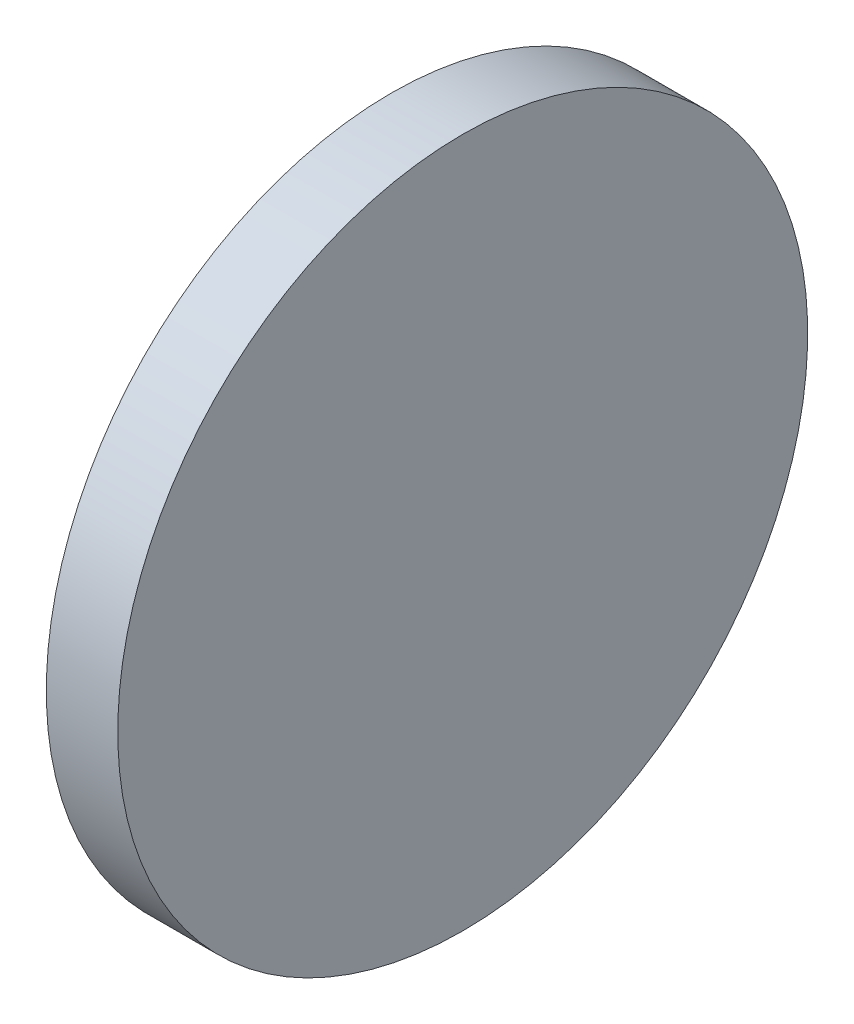
ISO-10303-21;
HEADER;
FILE_DESCRIPTION(('STEP AP214'),'2;1');
FILE_NAME('part.step','',(''),(''),'','','');
FILE_SCHEMA(('AUTOMOTIVE_DESIGN { 1 0 10303 214 1 1 1 1 }'));
ENDSEC;
DATA;
#1=APPLICATION_CONTEXT('core data for automotive mechanical design processes');
#2=APPLICATION_PROTOCOL_DEFINITION('international standard','automotive_design',2000,#1);
#3=PRODUCT_CONTEXT('',#1,'mechanical');
#4=PRODUCT('Part','Part','',(#3));
#5=PRODUCT_RELATED_PRODUCT_CATEGORY('part','',(#4));
#6=PRODUCT_DEFINITION_FORMATION('','',#4);
#7=PRODUCT_DEFINITION_CONTEXT('part definition',#1,'design');
#8=PRODUCT_DEFINITION('design','',#6,#7);
#9=PRODUCT_DEFINITION_SHAPE('','',#8);
#10=(LENGTH_UNIT() NAMED_UNIT(*) SI_UNIT(.MILLI.,.METRE.));
#11=(NAMED_UNIT(*) PLANE_ANGLE_UNIT() SI_UNIT($,.RADIAN.));
#12=(NAMED_UNIT(*) SI_UNIT($,.STERADIAN.) SOLID_ANGLE_UNIT());
#13=UNCERTAINTY_MEASURE_WITH_UNIT(LENGTH_MEASURE(1.E-05),#10,'distance_accuracy_value','');
#14=(GEOMETRIC_REPRESENTATION_CONTEXT(3) GLOBAL_UNCERTAINTY_ASSIGNED_CONTEXT((#13)) GLOBAL_UNIT_ASSIGNED_CONTEXT((#10,
#11,#12)) REPRESENTATION_CONTEXT('',''));
#15=CARTESIAN_POINT('',(0.,0.,0.));
#16=DIRECTION('',(0.,0.,1.));
#17=DIRECTION('',(1.,0.,0.));
#18=AXIS2_PLACEMENT_3D('',#15,#16,#17);
#19=CARTESIAN_POINT('',(566.111410679186,65.2168404709403,0.));
#20=DIRECTION('',(-1.,0.,0.));
#21=DIRECTION('',(0.,1.,0.));
#22=AXIS2_PLACEMENT_3D('',#19,#20,#21);
#23=SPHERICAL_SURFACE('',#22,443.5);
#24=CARTESIAN_POINT('',(122.787601257675,65.2168404709403,0.));
#25=DIRECTION('',(-1.,0.,0.));
#26=DIRECTION('',(0.,-1.,0.));
#27=AXIS2_PLACEMENT_3D('',#24,#25,#26);
#28=CIRCLE('',#27,12.4999999999999);
#29=CARTESIAN_POINT('',(122.787601257675,52.7168404709404,0.));
#30=VERTEX_POINT('',#29);
#31=EDGE_CURVE('E41',#30,#30,#28,.T.);
#32=ORIENTED_EDGE('',*,*,#31,.T.);
#33=EDGE_LOOP('',(#32));
#34=FACE_BOUND('',#33,.T.);
#35=ADVANCED_FACE('F35',(#34),#23,.T.);
#36=CARTESIAN_POINT('',(1325.31141067919,65.2168404709404,0.));
#37=DIRECTION('',(-1.,0.,0.));
#38=DIRECTION('',(0.,1.,0.));
#39=AXIS2_PLACEMENT_3D('',#36,#37,#38);
#40=SPHERICAL_SURFACE('',#39,1200.);
#41=CARTESIAN_POINT('',(125.376516612012,65.2168404709403,0.));
#42=DIRECTION('',(-1.,0.,0.));
#43=DIRECTION('',(0.,-1.,0.));
#44=AXIS2_PLACEMENT_3D('',#41,#42,#43);
#45=CIRCLE('',#44,12.5000000000002);
#46=CARTESIAN_POINT('',(125.376516612012,52.7168404709402,0.));
#47=VERTEX_POINT('',#46);
#48=EDGE_CURVE('E10',#47,#47,#45,.T.);
#49=ORIENTED_EDGE('',*,*,#48,.F.);
#50=EDGE_LOOP('',(#49));
#51=FACE_BOUND('',#50,.T.);
#52=ADVANCED_FACE('F50',(#51),#40,.F.);
#53=CARTESIAN_POINT('',(115.944491297963,65.2168404709403,0.));
#54=DIRECTION('',(-1.,0.,0.));
#55=DIRECTION('',(0.,-1.,0.));
#56=AXIS2_PLACEMENT_3D('',#53,#54,#55);
#57=CYLINDRICAL_SURFACE('',#56,12.5);
#58=ORIENTED_EDGE('',*,*,#31,.F.);
#59=EDGE_LOOP('',(#58));
#60=FACE_BOUND('',#59,.T.);
#61=ORIENTED_EDGE('',*,*,#48,.T.);
#62=EDGE_LOOP('',(#61));
#63=FACE_BOUND('',#62,.T.);
#64=ADVANCED_FACE('F48',(#60,#63),#57,.T.);
#65=CLOSED_SHELL('',(#35,#52,#64));
#66=MANIFOLD_SOLID_BREP('B2',#65);
#67=ADVANCED_BREP_SHAPE_REPRESENTATION('',(#18,#66),#14);
#68=SHAPE_DEFINITION_REPRESENTATION(#9,#67);
ENDSEC;
END-ISO-10303-21;
